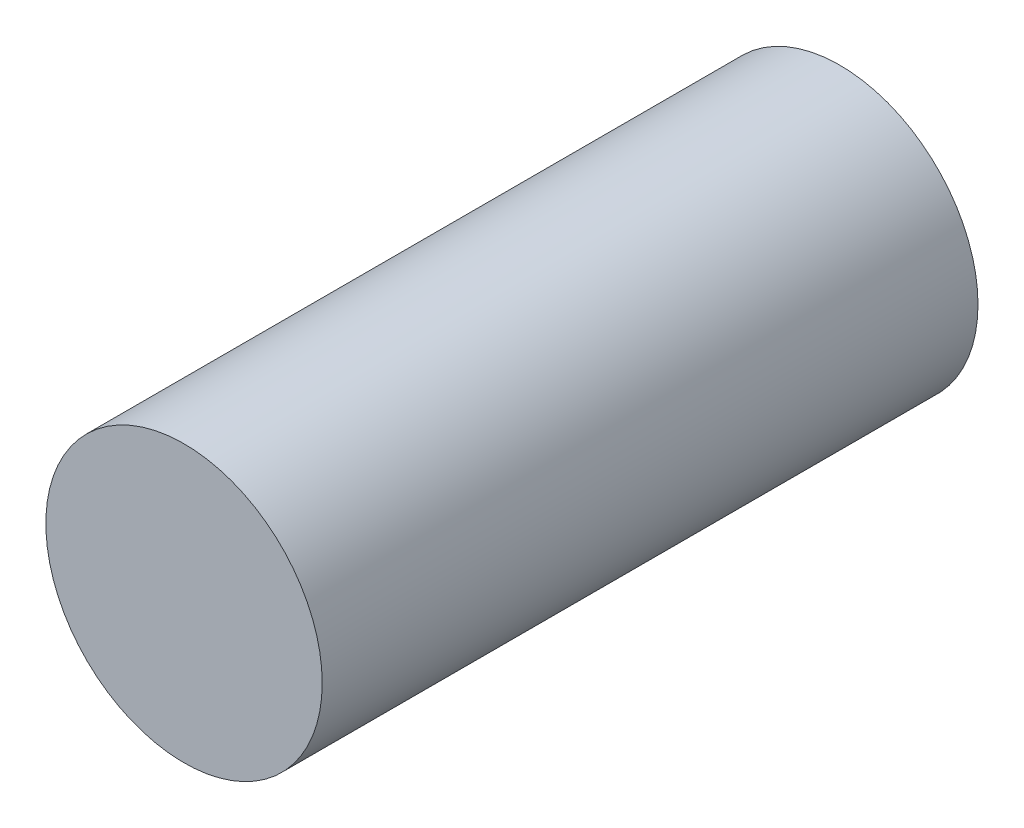
ISO-10303-21;
HEADER;
FILE_DESCRIPTION(('STEP AP214'),'2;1');
FILE_NAME('part.step','',(''),(''),'','','');
FILE_SCHEMA(('AUTOMOTIVE_DESIGN { 1 0 10303 214 1 1 1 1 }'));
ENDSEC;
DATA;
#1=APPLICATION_CONTEXT('core data for automotive mechanical design processes');
#2=APPLICATION_PROTOCOL_DEFINITION('international standard','automotive_design',2000,#1);
#3=PRODUCT_CONTEXT('',#1,'mechanical');
#4=PRODUCT('Part','Part','',(#3));
#5=PRODUCT_RELATED_PRODUCT_CATEGORY('part','',(#4));
#6=PRODUCT_DEFINITION_FORMATION('','',#4);
#7=PRODUCT_DEFINITION_CONTEXT('part definition',#1,'design');
#8=PRODUCT_DEFINITION('design','',#6,#7);
#9=PRODUCT_DEFINITION_SHAPE('','',#8);
#10=(LENGTH_UNIT() NAMED_UNIT(*) SI_UNIT(.MILLI.,.METRE.));
#11=(NAMED_UNIT(*) PLANE_ANGLE_UNIT() SI_UNIT($,.RADIAN.));
#12=(NAMED_UNIT(*) SI_UNIT($,.STERADIAN.) SOLID_ANGLE_UNIT());
#13=UNCERTAINTY_MEASURE_WITH_UNIT(LENGTH_MEASURE(1.E-05),#10,'distance_accuracy_value','');
#14=(GEOMETRIC_REPRESENTATION_CONTEXT(3) GLOBAL_UNCERTAINTY_ASSIGNED_CONTEXT((#13)) GLOBAL_UNIT_ASSIGNED_CONTEXT((#10,
#11,#12)) REPRESENTATION_CONTEXT('',''));
#15=CARTESIAN_POINT('',(0.,0.,0.));
#16=DIRECTION('',(0.,0.,1.));
#17=DIRECTION('',(1.,0.,0.));
#18=AXIS2_PLACEMENT_3D('',#15,#16,#17);
#19=CARTESIAN_POINT('',(0.,0.,14.));
#20=DIRECTION('',(0.,0.,-1.));
#21=DIRECTION('',(-1.,0.,0.));
#22=AXIS2_PLACEMENT_3D('',#19,#20,#21);
#23=CYLINDRICAL_SURFACE('',#22,2.95);
#24=CARTESIAN_POINT('',(0.,0.,14.));
#25=DIRECTION('',(0.,0.,1.));
#26=DIRECTION('',(1.,0.,0.));
#27=AXIS2_PLACEMENT_3D('',#24,#25,#26);
#28=CIRCLE('',#27,2.95);
#29=CARTESIAN_POINT('',(2.95,0.,14.));
#30=VERTEX_POINT('',#29);
#31=EDGE_CURVE('E10',#30,#30,#28,.T.);
#32=ORIENTED_EDGE('',*,*,#31,.F.);
#33=EDGE_LOOP('',(#32));
#34=FACE_BOUND('',#33,.T.);
#35=CARTESIAN_POINT('',(0.,0.,0.));
#36=DIRECTION('',(0.,0.,1.));
#37=DIRECTION('',(1.,0.,0.));
#38=AXIS2_PLACEMENT_3D('',#35,#36,#37);
#39=CIRCLE('',#38,2.95);
#40=CARTESIAN_POINT('',(2.95,0.,0.));
#41=VERTEX_POINT('',#40);
#42=EDGE_CURVE('E33',#41,#41,#39,.T.);
#43=ORIENTED_EDGE('',*,*,#42,.T.);
#44=EDGE_LOOP('',(#43));
#45=FACE_BOUND('',#44,.T.);
#46=ADVANCED_FACE('F30',(#34,#45),#23,.T.);
#47=CARTESIAN_POINT('',(0.,0.,14.));
#48=DIRECTION('',(0.,0.,1.));
#49=DIRECTION('',(1.,0.,0.));
#50=AXIS2_PLACEMENT_3D('',#47,#48,#49);
#51=PLANE('',#50);
#52=ORIENTED_EDGE('',*,*,#31,.T.);
#53=EDGE_LOOP('',(#52));
#54=FACE_BOUND('',#53,.T.);
#55=ADVANCED_FACE('F45',(#54),#51,.T.);
#56=CARTESIAN_POINT('',(0.,0.,0.));
#57=DIRECTION('',(0.,0.,1.));
#58=DIRECTION('',(1.,0.,0.));
#59=AXIS2_PLACEMENT_3D('',#56,#57,#58);
#60=PLANE('',#59);
#61=ORIENTED_EDGE('',*,*,#42,.F.);
#62=EDGE_LOOP('',(#61));
#63=FACE_BOUND('',#62,.T.);
#64=ADVANCED_FACE('F43',(#63),#60,.F.);
#65=CLOSED_SHELL('',(#46,#55,#64));
#66=MANIFOLD_SOLID_BREP('B2',#65);
#67=ADVANCED_BREP_SHAPE_REPRESENTATION('',(#18,#66),#14);
#68=SHAPE_DEFINITION_REPRESENTATION(#9,#67);
ENDSEC;
END-ISO-10303-21;
